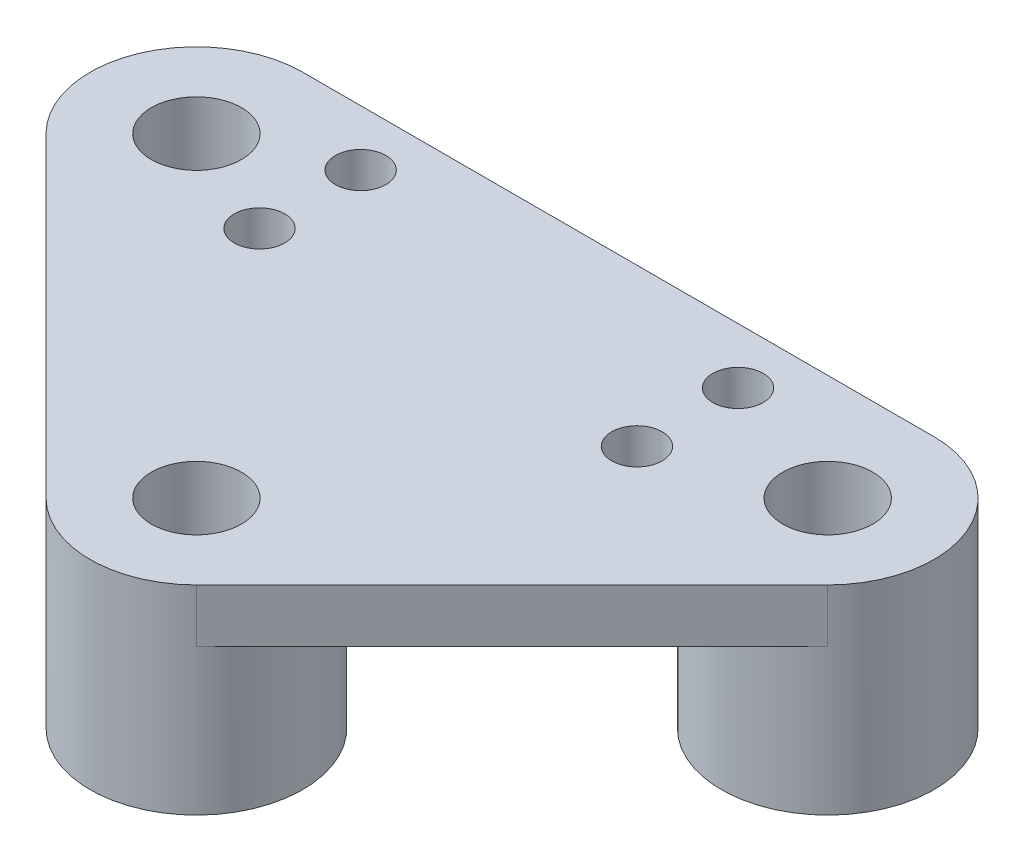
ISO-10303-21;
HEADER;
FILE_DESCRIPTION(('STEP AP214'),'2;1');
FILE_NAME('part.step','',(''),(''),'','','');
FILE_SCHEMA(('AUTOMOTIVE_DESIGN { 1 0 10303 214 1 1 1 1 }'));
ENDSEC;
DATA;
#1=APPLICATION_CONTEXT('core data for automotive mechanical design processes');
#2=APPLICATION_PROTOCOL_DEFINITION('international standard','automotive_design',2000,#1);
#3=PRODUCT_CONTEXT('',#1,'mechanical');
#4=PRODUCT('Part','Part','',(#3));
#5=PRODUCT_RELATED_PRODUCT_CATEGORY('part','',(#4));
#6=PRODUCT_DEFINITION_FORMATION('','',#4);
#7=PRODUCT_DEFINITION_CONTEXT('part definition',#1,'design');
#8=PRODUCT_DEFINITION('design','',#6,#7);
#9=PRODUCT_DEFINITION_SHAPE('','',#8);
#10=(LENGTH_UNIT() NAMED_UNIT(*) SI_UNIT(.MILLI.,.METRE.));
#11=(NAMED_UNIT(*) PLANE_ANGLE_UNIT() SI_UNIT($,.RADIAN.));
#12=(NAMED_UNIT(*) SI_UNIT($,.STERADIAN.) SOLID_ANGLE_UNIT());
#13=UNCERTAINTY_MEASURE_WITH_UNIT(LENGTH_MEASURE(1.E-05),#10,'distance_accuracy_value','');
#14=(GEOMETRIC_REPRESENTATION_CONTEXT(3) GLOBAL_UNCERTAINTY_ASSIGNED_CONTEXT((#13)) GLOBAL_UNIT_ASSIGNED_CONTEXT((#10,
#11,#12)) REPRESENTATION_CONTEXT('',''));
#15=CARTESIAN_POINT('',(0.,0.,0.));
#16=DIRECTION('',(0.,0.,1.));
#17=DIRECTION('',(1.,0.,0.));
#18=AXIS2_PLACEMENT_3D('',#15,#16,#17);
#19=CARTESIAN_POINT('',(-15.08125,-6.985,0.));
#20=DIRECTION('',(0.,-1.,0.));
#21=DIRECTION('',(0.,0.,-1.));
#22=AXIS2_PLACEMENT_3D('',#19,#20,#21);
#23=PLANE('',#22);
#24=CARTESIAN_POINT('',(-15.08125,-6.985,0.));
#25=DIRECTION('',(0.,1.,0.));
#26=DIRECTION('',(0.,0.,1.));
#27=AXIS2_PLACEMENT_3D('',#24,#25,#26);
#28=CIRCLE('',#27,2.15265);
#29=CARTESIAN_POINT('',(-15.08125,-6.985,2.15265));
#30=VERTEX_POINT('',#29);
#31=EDGE_CURVE('E196',#30,#30,#28,.T.);
#32=ORIENTED_EDGE('',*,*,#31,.T.);
#33=EDGE_LOOP('',(#32));
#34=FACE_BOUND('',#33,.T.);
#35=CARTESIAN_POINT('',(-15.08125,-6.985,0.));
#36=DIRECTION('',(0.,-1.,0.));
#37=DIRECTION('',(0.,0.,-1.));
#38=AXIS2_PLACEMENT_3D('',#35,#36,#37);
#39=CIRCLE('',#38,5.08);
#40=CARTESIAN_POINT('',(-10.1785652295985,-6.985,-1.33044430250705));
#41=VERTEX_POINT('',#40);
#42=CARTESIAN_POINT('',(-10.1785652295985,-6.985,1.33044430250705));
#43=VERTEX_POINT('',#42);
#44=EDGE_CURVE('E117',#41,#43,#39,.T.);
#45=ORIENTED_EDGE('',*,*,#44,.T.);
#46=CARTESIAN_POINT('',(-9.650000004,-6.985,2.414999996));
#47=DIRECTION('',(0.,1.,0.));
#48=DIRECTION('',(0.,0.,1.));
#49=AXIS2_PLACEMENT_3D('',#46,#47,#48);
#50=CIRCLE('',#49,1.2065);
#51=CARTESIAN_POINT('',(-10.8093384122214,-6.985,2.74903099040423));
#52=VERTEX_POINT('',#51);
#53=EDGE_CURVE('E50',#43,#52,#50,.T.);
#54=ORIENTED_EDGE('',*,*,#53,.T.);
#55=CARTESIAN_POINT('',(-10.8093384122214,-6.985,-2.74903099040423));
#56=VERTEX_POINT('',#55);
#57=EDGE_CURVE('E57',#52,#56,#39,.T.);
#58=ORIENTED_EDGE('',*,*,#57,.T.);
#59=CARTESIAN_POINT('',(-9.650000004,-6.985,-2.414999996));
#60=DIRECTION('',(0.,1.,0.));
#61=DIRECTION('',(0.,0.,1.));
#62=AXIS2_PLACEMENT_3D('',#59,#60,#61);
#63=CIRCLE('',#62,1.2065);
#64=EDGE_CURVE('E183',#56,#41,#63,.T.);
#65=ORIENTED_EDGE('',*,*,#64,.T.);
#66=EDGE_LOOP('',(#45,#54,#58,#65));
#67=FACE_BOUND('',#66,.T.);
#68=ADVANCED_FACE('F35',(#34,#67),#23,.T.);
#69=CARTESIAN_POINT('',(-15.08125,2.54,0.));
#70=DIRECTION('',(0.,-1.,0.));
#71=DIRECTION('',(0.,0.,-1.));
#72=AXIS2_PLACEMENT_3D('',#69,#70,#71);
#73=CYLINDRICAL_SURFACE('',#72,5.08);
#74=ORIENTED_EDGE('',*,*,#57,.F.);
#75=DIRECTION('',(0.,1.,0.));
#76=VECTOR('',#75,1.);
#77=CARTESIAN_POINT('',(-10.8093384122214,-2.2225,2.74903099040423));
#78=LINE('',#77,#76);
#79=CARTESIAN_POINT('',(-10.8093384122214,0.,2.74903099040423));
#80=VERTEX_POINT('',#79);
#81=EDGE_CURVE('E11',#52,#80,#78,.T.);
#82=ORIENTED_EDGE('',*,*,#81,.T.);
#83=CARTESIAN_POINT('',(-15.08125,0.,0.));
#84=DIRECTION('',(0.,-1.,0.));
#85=DIRECTION('',(0.,0.,-1.));
#86=AXIS2_PLACEMENT_3D('',#83,#84,#85);
#87=CIRCLE('',#86,5.08);
#88=CARTESIAN_POINT('',(-18.6733524484277,0.,3.59210244842766));
#89=VERTEX_POINT('',#88);
#90=EDGE_CURVE('E129',#80,#89,#87,.T.);
#91=ORIENTED_EDGE('',*,*,#90,.T.);
#92=DIRECTION('',(0.,-1.,0.));
#93=VECTOR('',#92,1.);
#94=CARTESIAN_POINT('',(-18.6733524484277,2.54,3.59210244842766));
#95=LINE('',#94,#93);
#96=CARTESIAN_POINT('',(-18.6733524484277,2.54,3.59210244842766));
#97=VERTEX_POINT('',#96);
#98=EDGE_CURVE('E170',#97,#89,#95,.T.);
#99=ORIENTED_EDGE('',*,*,#98,.F.);
#100=CARTESIAN_POINT('',(-15.08125,2.54,0.));
#101=DIRECTION('',(0.,1.,0.));
#102=DIRECTION('',(0.,0.,1.));
#103=AXIS2_PLACEMENT_3D('',#100,#101,#102);
#104=CIRCLE('',#103,5.08);
#105=CARTESIAN_POINT('',(-15.08125,2.54,-5.08));
#106=VERTEX_POINT('',#105);
#107=EDGE_CURVE('E134',#106,#97,#104,.T.);
#108=ORIENTED_EDGE('',*,*,#107,.F.);
#109=DIRECTION('',(0.,-1.,0.));
#110=VECTOR('',#109,1.);
#111=CARTESIAN_POINT('',(-15.08125,2.54,-5.08));
#112=LINE('',#111,#110);
#113=CARTESIAN_POINT('',(-15.08125,0.,-5.08));
#114=VERTEX_POINT('',#113);
#115=EDGE_CURVE('E148',#106,#114,#112,.T.);
#116=ORIENTED_EDGE('',*,*,#115,.T.);
#117=CARTESIAN_POINT('',(-10.8093384122214,0.,-2.74903099040423));
#118=VERTEX_POINT('',#117);
#119=EDGE_CURVE('E124',#114,#118,#87,.T.);
#120=ORIENTED_EDGE('',*,*,#119,.T.);
#121=DIRECTION('',(0.,1.,0.));
#122=VECTOR('',#121,1.);
#123=CARTESIAN_POINT('',(-10.8093384122214,-2.2225,-2.74903099040423));
#124=LINE('',#123,#122);
#125=EDGE_CURVE('E123',#118,#56,#124,.F.);
#126=ORIENTED_EDGE('',*,*,#125,.T.);
#127=EDGE_LOOP('',(#74,#82,#91,#99,#108,#116,#120,#126));
#128=FACE_BOUND('',#127,.T.);
#129=ADVANCED_FACE('F121',(#128),#73,.T.);
#130=CARTESIAN_POINT('',(-15.08125,0.,0.));
#131=DIRECTION('',(0.,1.,0.));
#132=DIRECTION('',(0.,0.,1.));
#133=AXIS2_PLACEMENT_3D('',#130,#131,#132);
#134=PLANE('',#133);
#135=CARTESIAN_POINT('',(8.380000004,0.,2.414999996));
#136=DIRECTION('',(0.,1.,0.));
#137=DIRECTION('',(0.,0.,1.));
#138=AXIS2_PLACEMENT_3D('',#135,#136,#137);
#139=CIRCLE('',#138,1.2065);
#140=CARTESIAN_POINT('',(8.380000004,0.,3.62149999599999));
#141=VERTEX_POINT('',#140);
#142=EDGE_CURVE('E438',#141,#141,#139,.T.);
#143=ORIENTED_EDGE('',*,*,#142,.T.);
#144=EDGE_LOOP('',(#143));
#145=FACE_BOUND('',#144,.T.);
#146=CARTESIAN_POINT('',(8.380000004,0.,-2.414999996));
#147=DIRECTION('',(0.,1.,0.));
#148=DIRECTION('',(0.,0.,1.));
#149=AXIS2_PLACEMENT_3D('',#146,#147,#148);
#150=CIRCLE('',#149,1.2065);
#151=CARTESIAN_POINT('',(8.380000004,0.,-1.208499996));
#152=VERTEX_POINT('',#151);
#153=EDGE_CURVE('E442',#152,#152,#150,.T.);
#154=ORIENTED_EDGE('',*,*,#153,.T.);
#155=EDGE_LOOP('',(#154));
#156=FACE_BOUND('',#155,.T.);
#157=ORIENTED_EDGE('',*,*,#90,.F.);
#158=CARTESIAN_POINT('',(-9.650000004,0.,2.414999996));
#159=DIRECTION('',(0.,1.,0.));
#160=DIRECTION('',(0.,0.,1.));
#161=AXIS2_PLACEMENT_3D('',#158,#159,#160);
#162=CIRCLE('',#161,1.2065);
#163=CARTESIAN_POINT('',(-10.1785652295985,0.,1.33044430250705));
#164=VERTEX_POINT('',#163);
#165=EDGE_CURVE('E112',#80,#164,#162,.T.);
#166=ORIENTED_EDGE('',*,*,#165,.T.);
#167=CARTESIAN_POINT('',(-10.1785652295985,0.,-1.33044430250705));
#168=VERTEX_POINT('',#167);
#169=EDGE_CURVE('E127',#168,#164,#87,.T.);
#170=ORIENTED_EDGE('',*,*,#169,.F.);
#171=CARTESIAN_POINT('',(-9.650000004,0.,-2.414999996));
#172=DIRECTION('',(0.,1.,0.));
#173=DIRECTION('',(0.,0.,1.));
#174=AXIS2_PLACEMENT_3D('',#171,#172,#173);
#175=CIRCLE('',#174,1.2065);
#176=EDGE_CURVE('E189',#168,#118,#175,.T.);
#177=ORIENTED_EDGE('',*,*,#176,.T.);
#178=ORIENTED_EDGE('',*,*,#119,.F.);
#179=DIRECTION('',(-1.,0.,0.));
#180=VECTOR('',#179,1.);
#181=CARTESIAN_POINT('',(-15.08125,0.,-5.08));
#182=LINE('',#181,#180);
#183=CARTESIAN_POINT('',(15.08125,0.,-5.08));
#184=VERTEX_POINT('',#183);
#185=EDGE_CURVE('E138',#184,#114,#182,.T.);
#186=ORIENTED_EDGE('',*,*,#185,.F.);
#187=CARTESIAN_POINT('',(15.08125,0.,0.));
#188=DIRECTION('',(0.,-1.,0.));
#189=DIRECTION('',(0.,0.,-1.));
#190=AXIS2_PLACEMENT_3D('',#187,#188,#189);
#191=CIRCLE('',#190,5.08);
#192=CARTESIAN_POINT('',(18.6733524484277,0.,3.59210244842765));
#193=VERTEX_POINT('',#192);
#194=EDGE_CURVE('E211',#193,#184,#191,.T.);
#195=ORIENTED_EDGE('',*,*,#194,.F.);
#196=DIRECTION('',(0.707106781186547,0.,-0.707106781186548));
#197=VECTOR('',#196,1.);
#198=CARTESIAN_POINT('',(18.6733524484277,0.,3.59210244842765));
#199=LINE('',#198,#197);
#200=CARTESIAN_POINT('',(3.59210244842766,0.,18.6733524484277));
#201=VERTEX_POINT('',#200);
#202=EDGE_CURVE('E151',#201,#193,#199,.T.);
#203=ORIENTED_EDGE('',*,*,#202,.F.);
#204=CARTESIAN_POINT('',(0.,0.,15.08125));
#205=DIRECTION('',(0.,-1.,0.));
#206=DIRECTION('',(0.,0.,-1.));
#207=AXIS2_PLACEMENT_3D('',#204,#205,#206);
#208=CIRCLE('',#207,5.08);
#209=CARTESIAN_POINT('',(-3.59210244842766,0.,18.6733524484277));
#210=VERTEX_POINT('',#209);
#211=EDGE_CURVE('E131',#210,#201,#208,.T.);
#212=ORIENTED_EDGE('',*,*,#211,.F.);
#213=DIRECTION('',(0.707106781186548,0.,0.707106781186547));
#214=VECTOR('',#213,1.);
#215=CARTESIAN_POINT('',(-3.59210244842766,0.,18.6733524484277));
#216=LINE('',#215,#214);
#217=EDGE_CURVE('E126',#89,#210,#216,.T.);
#218=ORIENTED_EDGE('',*,*,#217,.F.);
#219=EDGE_LOOP('',(#157,#166,#170,#177,#178,#186,#195,#203,#212,#218));
#220=FACE_BOUND('',#219,.T.);
#221=ADVANCED_FACE('F177',(#145,#156,#220),#134,.F.);
#222=ORIENTED_EDGE('',*,*,#169,.T.);
#223=DIRECTION('',(0.,1.,0.));
#224=VECTOR('',#223,1.);
#225=CARTESIAN_POINT('',(-10.1785652295985,-2.2225,1.33044430250705));
#226=LINE('',#225,#224);
#227=EDGE_CURVE('E43',#164,#43,#226,.F.);
#228=ORIENTED_EDGE('',*,*,#227,.T.);
#229=ORIENTED_EDGE('',*,*,#44,.F.);
#230=DIRECTION('',(0.,1.,0.));
#231=VECTOR('',#230,1.);
#232=CARTESIAN_POINT('',(-10.1785652295985,-2.2225,-1.33044430250705));
#233=LINE('',#232,#231);
#234=EDGE_CURVE('E191',#41,#168,#233,.T.);
#235=ORIENTED_EDGE('',*,*,#234,.T.);
#236=EDGE_LOOP('',(#222,#228,#229,#235));
#237=FACE_BOUND('',#236,.T.);
#238=ADVANCED_FACE('F37',(#237),#73,.T.);
#239=CARTESIAN_POINT('',(-3.59210244842766,2.54,18.6733524484277));
#240=DIRECTION('',(0.707106781186547,0.,-0.707106781186548));
#241=DIRECTION('',(-0.707106781186548,0.,-0.707106781186547));
#242=AXIS2_PLACEMENT_3D('',#239,#240,#241);
#243=PLANE('',#242);
#244=ORIENTED_EDGE('',*,*,#217,.T.);
#245=DIRECTION('',(0.,-1.,0.));
#246=VECTOR('',#245,1.);
#247=CARTESIAN_POINT('',(-3.59210244842766,2.54,18.6733524484277));
#248=LINE('',#247,#246);
#249=CARTESIAN_POINT('',(-3.59210244842766,2.54,18.6733524484277));
#250=VERTEX_POINT('',#249);
#251=EDGE_CURVE('E167',#250,#210,#248,.T.);
#252=ORIENTED_EDGE('',*,*,#251,.F.);
#253=DIRECTION('',(0.707106781186548,0.,0.707106781186547));
#254=VECTOR('',#253,1.);
#255=CARTESIAN_POINT('',(-3.59210244842766,2.54,18.6733524484277));
#256=LINE('',#255,#254);
#257=EDGE_CURVE('E137',#97,#250,#256,.T.);
#258=ORIENTED_EDGE('',*,*,#257,.F.);
#259=ORIENTED_EDGE('',*,*,#98,.T.);
#260=EDGE_LOOP('',(#244,#252,#258,#259));
#261=FACE_BOUND('',#260,.T.);
#262=ADVANCED_FACE('F245',(#261),#243,.F.);
#263=CARTESIAN_POINT('',(0.,2.54,15.08125));
#264=DIRECTION('',(0.,-1.,0.));
#265=DIRECTION('',(0.,0.,-1.));
#266=AXIS2_PLACEMENT_3D('',#263,#264,#265);
#267=CYLINDRICAL_SURFACE('',#266,5.08);
#268=ORIENTED_EDGE('',*,*,#251,.T.);
#269=ORIENTED_EDGE('',*,*,#211,.T.);
#270=DIRECTION('',(0.,-1.,0.));
#271=VECTOR('',#270,1.);
#272=CARTESIAN_POINT('',(3.59210244842766,2.54,18.6733524484277));
#273=LINE('',#272,#271);
#274=CARTESIAN_POINT('',(3.59210244842766,2.54,18.6733524484277));
#275=VERTEX_POINT('',#274);
#276=EDGE_CURVE('E164',#275,#201,#273,.T.);
#277=ORIENTED_EDGE('',*,*,#276,.F.);
#278=CARTESIAN_POINT('',(0.,2.54,15.08125));
#279=DIRECTION('',(0.,1.,0.));
#280=DIRECTION('',(0.,0.,1.));
#281=AXIS2_PLACEMENT_3D('',#278,#279,#280);
#282=CIRCLE('',#281,5.08);
#283=EDGE_CURVE('E140',#250,#275,#282,.T.);
#284=ORIENTED_EDGE('',*,*,#283,.F.);
#285=EDGE_LOOP('',(#268,#269,#277,#284));
#286=FACE_BOUND('',#285,.T.);
#287=CARTESIAN_POINT('',(0.,-6.985,15.08125));
#288=DIRECTION('',(0.,-1.,0.));
#289=DIRECTION('',(0.,0.,-1.));
#290=AXIS2_PLACEMENT_3D('',#287,#288,#289);
#291=CIRCLE('',#290,5.08);
#292=CARTESIAN_POINT('',(0.,-6.985,10.00125));
#293=VERTEX_POINT('',#292);
#294=EDGE_CURVE('E215',#293,#293,#291,.T.);
#295=ORIENTED_EDGE('',*,*,#294,.F.);
#296=EDGE_LOOP('',(#295));
#297=FACE_BOUND('',#296,.T.);
#298=ADVANCED_FACE('F221',(#286,#297),#267,.T.);
#299=CARTESIAN_POINT('',(18.6733524484277,2.54,3.59210244842765));
#300=DIRECTION('',(-0.707106781186548,0.,-0.707106781186547));
#301=DIRECTION('',(-0.707106781186547,0.,0.707106781186548));
#302=AXIS2_PLACEMENT_3D('',#299,#300,#301);
#303=PLANE('',#302);
#304=ORIENTED_EDGE('',*,*,#202,.T.);
#305=DIRECTION('',(0.,-1.,0.));
#306=VECTOR('',#305,1.);
#307=CARTESIAN_POINT('',(18.6733524484277,2.54,3.59210244842765));
#308=LINE('',#307,#306);
#309=CARTESIAN_POINT('',(18.6733524484277,2.54,3.59210244842765));
#310=VERTEX_POINT('',#309);
#311=EDGE_CURVE('E161',#310,#193,#308,.T.);
#312=ORIENTED_EDGE('',*,*,#311,.F.);
#313=DIRECTION('',(0.707106781186547,0.,-0.707106781186548));
#314=VECTOR('',#313,1.);
#315=CARTESIAN_POINT('',(18.6733524484277,2.54,3.59210244842765));
#316=LINE('',#315,#314);
#317=EDGE_CURVE('E142',#275,#310,#316,.T.);
#318=ORIENTED_EDGE('',*,*,#317,.F.);
#319=ORIENTED_EDGE('',*,*,#276,.T.);
#320=EDGE_LOOP('',(#304,#312,#318,#319));
#321=FACE_BOUND('',#320,.T.);
#322=ADVANCED_FACE('F228',(#321),#303,.F.);
#323=CARTESIAN_POINT('',(15.08125,2.54,0.));
#324=DIRECTION('',(0.,-1.,0.));
#325=DIRECTION('',(0.,0.,-1.));
#326=AXIS2_PLACEMENT_3D('',#323,#324,#325);
#327=CYLINDRICAL_SURFACE('',#326,5.08);
#328=ORIENTED_EDGE('',*,*,#311,.T.);
#329=ORIENTED_EDGE('',*,*,#194,.T.);
#330=DIRECTION('',(0.,-1.,0.));
#331=VECTOR('',#330,1.);
#332=CARTESIAN_POINT('',(15.08125,2.54,-5.08));
#333=LINE('',#332,#331);
#334=CARTESIAN_POINT('',(15.08125,2.54,-5.08));
#335=VERTEX_POINT('',#334);
#336=EDGE_CURVE('E158',#335,#184,#333,.T.);
#337=ORIENTED_EDGE('',*,*,#336,.F.);
#338=CARTESIAN_POINT('',(15.08125,2.54,0.));
#339=DIRECTION('',(0.,1.,0.));
#340=DIRECTION('',(0.,0.,1.));
#341=AXIS2_PLACEMENT_3D('',#338,#339,#340);
#342=CIRCLE('',#341,5.08);
#343=EDGE_CURVE('E144',#310,#335,#342,.T.);
#344=ORIENTED_EDGE('',*,*,#343,.F.);
#345=EDGE_LOOP('',(#328,#329,#337,#344));
#346=FACE_BOUND('',#345,.T.);
#347=CARTESIAN_POINT('',(15.08125,-6.985,0.));
#348=DIRECTION('',(0.,-1.,0.));
#349=DIRECTION('',(0.,0.,-1.));
#350=AXIS2_PLACEMENT_3D('',#347,#348,#349);
#351=CIRCLE('',#350,5.08);
#352=CARTESIAN_POINT('',(15.08125,-6.985,-5.08));
#353=VERTEX_POINT('',#352);
#354=EDGE_CURVE('E212',#353,#353,#351,.T.);
#355=ORIENTED_EDGE('',*,*,#354,.F.);
#356=EDGE_LOOP('',(#355));
#357=FACE_BOUND('',#356,.T.);
#358=ADVANCED_FACE('F233',(#346,#357),#327,.T.);
#359=CARTESIAN_POINT('',(-15.08125,2.54,-5.08));
#360=DIRECTION('',(0.,0.,1.));
#361=DIRECTION('',(1.,0.,0.));
#362=AXIS2_PLACEMENT_3D('',#359,#360,#361);
#363=PLANE('',#362);
#364=ORIENTED_EDGE('',*,*,#185,.T.);
#365=ORIENTED_EDGE('',*,*,#115,.F.);
#366=DIRECTION('',(-1.,0.,0.));
#367=VECTOR('',#366,1.);
#368=CARTESIAN_POINT('',(-15.08125,2.54,-5.08));
#369=LINE('',#368,#367);
#370=EDGE_CURVE('E146',#335,#106,#369,.T.);
#371=ORIENTED_EDGE('',*,*,#370,.F.);
#372=ORIENTED_EDGE('',*,*,#336,.T.);
#373=EDGE_LOOP('',(#364,#365,#371,#372));
#374=FACE_BOUND('',#373,.T.);
#375=ADVANCED_FACE('F238',(#374),#363,.F.);
#376=CARTESIAN_POINT('',(-15.08125,2.54,0.));
#377=DIRECTION('',(0.,1.,0.));
#378=DIRECTION('',(0.,0.,1.));
#379=AXIS2_PLACEMENT_3D('',#376,#377,#378);
#380=PLANE('',#379);
#381=CARTESIAN_POINT('',(8.380000004,2.54,2.414999996));
#382=DIRECTION('',(0.,1.,0.));
#383=DIRECTION('',(0.,0.,1.));
#384=AXIS2_PLACEMENT_3D('',#381,#382,#383);
#385=CIRCLE('',#384,1.2065);
#386=CARTESIAN_POINT('',(8.380000004,2.54,3.621499996));
#387=VERTEX_POINT('',#386);
#388=EDGE_CURVE('E435',#387,#387,#385,.T.);
#389=ORIENTED_EDGE('',*,*,#388,.F.);
#390=EDGE_LOOP('',(#389));
#391=FACE_BOUND('',#390,.T.);
#392=CARTESIAN_POINT('',(8.380000004,2.54,-2.414999996));
#393=DIRECTION('',(0.,1.,0.));
#394=DIRECTION('',(0.,0.,1.));
#395=AXIS2_PLACEMENT_3D('',#392,#393,#394);
#396=CIRCLE('',#395,1.2065);
#397=CARTESIAN_POINT('',(8.380000004,2.54,-1.208499996));
#398=VERTEX_POINT('',#397);
#399=EDGE_CURVE('E439',#398,#398,#396,.T.);
#400=ORIENTED_EDGE('',*,*,#399,.F.);
#401=EDGE_LOOP('',(#400));
#402=FACE_BOUND('',#401,.T.);
#403=CARTESIAN_POINT('',(-9.650000004,2.54,2.414999996));
#404=DIRECTION('',(0.,1.,0.));
#405=DIRECTION('',(0.,0.,1.));
#406=AXIS2_PLACEMENT_3D('',#403,#404,#405);
#407=CIRCLE('',#406,1.2065);
#408=CARTESIAN_POINT('',(-9.650000004,2.54,3.621499996));
#409=VERTEX_POINT('',#408);
#410=EDGE_CURVE('E118',#409,#409,#407,.T.);
#411=ORIENTED_EDGE('',*,*,#410,.F.);
#412=EDGE_LOOP('',(#411));
#413=FACE_BOUND('',#412,.T.);
#414=CARTESIAN_POINT('',(-9.650000004,2.54,-2.414999996));
#415=DIRECTION('',(0.,1.,0.));
#416=DIRECTION('',(0.,0.,1.));
#417=AXIS2_PLACEMENT_3D('',#414,#415,#416);
#418=CIRCLE('',#417,1.2065);
#419=CARTESIAN_POINT('',(-9.650000004,2.54,-1.208499996));
#420=VERTEX_POINT('',#419);
#421=EDGE_CURVE('E180',#420,#420,#418,.T.);
#422=ORIENTED_EDGE('',*,*,#421,.F.);
#423=EDGE_LOOP('',(#422));
#424=FACE_BOUND('',#423,.T.);
#425=CARTESIAN_POINT('',(-15.08125,2.54,0.));
#426=DIRECTION('',(0.,1.,0.));
#427=DIRECTION('',(0.,0.,1.));
#428=AXIS2_PLACEMENT_3D('',#425,#426,#427);
#429=CIRCLE('',#428,2.15265);
#430=CARTESIAN_POINT('',(-15.08125,2.54,2.15265));
#431=VERTEX_POINT('',#430);
#432=EDGE_CURVE('E193',#431,#431,#429,.T.);
#433=ORIENTED_EDGE('',*,*,#432,.F.);
#434=EDGE_LOOP('',(#433));
#435=FACE_BOUND('',#434,.T.);
#436=CARTESIAN_POINT('',(0.,2.54,15.08125));
#437=DIRECTION('',(0.,1.,0.));
#438=DIRECTION('',(0.,0.,1.));
#439=AXIS2_PLACEMENT_3D('',#436,#437,#438);
#440=CIRCLE('',#439,2.15265);
#441=CARTESIAN_POINT('',(0.,2.54,17.2339));
#442=VERTEX_POINT('',#441);
#443=EDGE_CURVE('E199',#442,#442,#440,.T.);
#444=ORIENTED_EDGE('',*,*,#443,.F.);
#445=EDGE_LOOP('',(#444));
#446=FACE_BOUND('',#445,.T.);
#447=CARTESIAN_POINT('',(15.08125,2.54,0.));
#448=DIRECTION('',(0.,1.,0.));
#449=DIRECTION('',(0.,0.,1.));
#450=AXIS2_PLACEMENT_3D('',#447,#448,#449);
#451=CIRCLE('',#450,2.15265);
#452=CARTESIAN_POINT('',(15.08125,2.54,2.15264999999999));
#453=VERTEX_POINT('',#452);
#454=EDGE_CURVE('E205',#453,#453,#451,.T.);
#455=ORIENTED_EDGE('',*,*,#454,.F.);
#456=EDGE_LOOP('',(#455));
#457=FACE_BOUND('',#456,.T.);
#458=ORIENTED_EDGE('',*,*,#107,.T.);
#459=ORIENTED_EDGE('',*,*,#257,.T.);
#460=ORIENTED_EDGE('',*,*,#283,.T.);
#461=ORIENTED_EDGE('',*,*,#317,.T.);
#462=ORIENTED_EDGE('',*,*,#343,.T.);
#463=ORIENTED_EDGE('',*,*,#370,.T.);
#464=EDGE_LOOP('',(#458,#459,#460,#461,#462,#463));
#465=FACE_BOUND('',#464,.T.);
#466=ADVANCED_FACE('F242',(#391,#402,#413,#424,#435,#446,#457,#465),#380,.T.);
#467=CARTESIAN_POINT('',(0.,-6.985,15.08125));
#468=DIRECTION('',(0.,-1.,0.));
#469=DIRECTION('',(0.,0.,-1.));
#470=AXIS2_PLACEMENT_3D('',#467,#468,#469);
#471=PLANE('',#470);
#472=CARTESIAN_POINT('',(0.,-6.985,15.08125));
#473=DIRECTION('',(0.,1.,0.));
#474=DIRECTION('',(0.,0.,1.));
#475=AXIS2_PLACEMENT_3D('',#472,#473,#474);
#476=CIRCLE('',#475,2.15265);
#477=CARTESIAN_POINT('',(0.,-6.985,17.2339));
#478=VERTEX_POINT('',#477);
#479=EDGE_CURVE('E202',#478,#478,#476,.T.);
#480=ORIENTED_EDGE('',*,*,#479,.T.);
#481=EDGE_LOOP('',(#480));
#482=FACE_BOUND('',#481,.T.);
#483=ORIENTED_EDGE('',*,*,#294,.T.);
#484=EDGE_LOOP('',(#483));
#485=FACE_BOUND('',#484,.T.);
#486=ADVANCED_FACE('F270',(#482,#485),#471,.T.);
#487=CARTESIAN_POINT('',(15.08125,-6.985,0.));
#488=DIRECTION('',(0.,-1.,0.));
#489=DIRECTION('',(0.,0.,-1.));
#490=AXIS2_PLACEMENT_3D('',#487,#488,#489);
#491=PLANE('',#490);
#492=CARTESIAN_POINT('',(15.08125,-6.985,0.));
#493=DIRECTION('',(0.,1.,0.));
#494=DIRECTION('',(0.,0.,1.));
#495=AXIS2_PLACEMENT_3D('',#492,#493,#494);
#496=CIRCLE('',#495,2.15265);
#497=CARTESIAN_POINT('',(15.08125,-6.985,2.15264999999999));
#498=VERTEX_POINT('',#497);
#499=EDGE_CURVE('E208',#498,#498,#496,.T.);
#500=ORIENTED_EDGE('',*,*,#499,.T.);
#501=EDGE_LOOP('',(#500));
#502=FACE_BOUND('',#501,.T.);
#503=ORIENTED_EDGE('',*,*,#354,.T.);
#504=EDGE_LOOP('',(#503));
#505=FACE_BOUND('',#504,.T.);
#506=ADVANCED_FACE('F331',(#502,#505),#491,.T.);
#507=CARTESIAN_POINT('',(15.08125,2.54,0.));
#508=DIRECTION('',(0.,1.,0.));
#509=DIRECTION('',(0.,0.,1.));
#510=AXIS2_PLACEMENT_3D('',#507,#508,#509);
#511=CYLINDRICAL_SURFACE('',#510,2.15265);
#512=ORIENTED_EDGE('',*,*,#499,.F.);
#513=EDGE_LOOP('',(#512));
#514=FACE_BOUND('',#513,.T.);
#515=ORIENTED_EDGE('',*,*,#454,.T.);
#516=EDGE_LOOP('',(#515));
#517=FACE_BOUND('',#516,.T.);
#518=ADVANCED_FACE('F321',(#514,#517),#511,.F.);
#519=CARTESIAN_POINT('',(0.,2.54,15.08125));
#520=DIRECTION('',(0.,1.,0.));
#521=DIRECTION('',(0.,0.,1.));
#522=AXIS2_PLACEMENT_3D('',#519,#520,#521);
#523=CYLINDRICAL_SURFACE('',#522,2.15265);
#524=ORIENTED_EDGE('',*,*,#479,.F.);
#525=EDGE_LOOP('',(#524));
#526=FACE_BOUND('',#525,.T.);
#527=ORIENTED_EDGE('',*,*,#443,.T.);
#528=EDGE_LOOP('',(#527));
#529=FACE_BOUND('',#528,.T.);
#530=ADVANCED_FACE('F259',(#526,#529),#523,.F.);
#531=CARTESIAN_POINT('',(-15.08125,2.54,0.));
#532=DIRECTION('',(0.,1.,0.));
#533=DIRECTION('',(0.,0.,1.));
#534=AXIS2_PLACEMENT_3D('',#531,#532,#533);
#535=CYLINDRICAL_SURFACE('',#534,2.15265);
#536=ORIENTED_EDGE('',*,*,#31,.F.);
#537=EDGE_LOOP('',(#536));
#538=FACE_BOUND('',#537,.T.);
#539=ORIENTED_EDGE('',*,*,#432,.T.);
#540=EDGE_LOOP('',(#539));
#541=FACE_BOUND('',#540,.T.);
#542=ADVANCED_FACE('F249',(#538,#541),#535,.F.);
#543=CARTESIAN_POINT('',(-9.650000004,2.54,-2.414999996));
#544=DIRECTION('',(0.,1.,0.));
#545=DIRECTION('',(0.,0.,1.));
#546=AXIS2_PLACEMENT_3D('',#543,#544,#545);
#547=CYLINDRICAL_SURFACE('',#546,1.2065);
#548=ORIENTED_EDGE('',*,*,#421,.T.);
#549=EDGE_LOOP('',(#548));
#550=FACE_BOUND('',#549,.T.);
#551=ORIENTED_EDGE('',*,*,#64,.F.);
#552=ORIENTED_EDGE('',*,*,#125,.F.);
#553=ORIENTED_EDGE('',*,*,#176,.F.);
#554=ORIENTED_EDGE('',*,*,#234,.F.);
#555=EDGE_LOOP('',(#551,#552,#553,#554));
#556=FACE_BOUND('',#555,.T.);
#557=ADVANCED_FACE('F247',(#550,#556),#547,.F.);
#558=CARTESIAN_POINT('',(-9.650000004,2.54,2.414999996));
#559=DIRECTION('',(0.,1.,0.));
#560=DIRECTION('',(0.,0.,1.));
#561=AXIS2_PLACEMENT_3D('',#558,#559,#560);
#562=CYLINDRICAL_SURFACE('',#561,1.2065);
#563=ORIENTED_EDGE('',*,*,#410,.T.);
#564=EDGE_LOOP('',(#563));
#565=FACE_BOUND('',#564,.T.);
#566=ORIENTED_EDGE('',*,*,#53,.F.);
#567=ORIENTED_EDGE('',*,*,#227,.F.);
#568=ORIENTED_EDGE('',*,*,#165,.F.);
#569=ORIENTED_EDGE('',*,*,#81,.F.);
#570=EDGE_LOOP('',(#566,#567,#568,#569));
#571=FACE_BOUND('',#570,.T.);
#572=ADVANCED_FACE('F110',(#565,#571),#562,.F.);
#573=CARTESIAN_POINT('',(8.380000004,2.54,-2.414999996));
#574=DIRECTION('',(0.,1.,0.));
#575=DIRECTION('',(0.,0.,1.));
#576=AXIS2_PLACEMENT_3D('',#573,#574,#575);
#577=CYLINDRICAL_SURFACE('',#576,1.2065);
#578=ORIENTED_EDGE('',*,*,#399,.T.);
#579=EDGE_LOOP('',(#578));
#580=FACE_BOUND('',#579,.T.);
#581=ORIENTED_EDGE('',*,*,#153,.F.);
#582=EDGE_LOOP('',(#581));
#583=FACE_BOUND('',#582,.T.);
#584=ADVANCED_FACE('F256',(#580,#583),#577,.F.);
#585=CARTESIAN_POINT('',(8.380000004,2.54,2.414999996));
#586=DIRECTION('',(0.,1.,0.));
#587=DIRECTION('',(0.,0.,1.));
#588=AXIS2_PLACEMENT_3D('',#585,#586,#587);
#589=CYLINDRICAL_SURFACE('',#588,1.2065);
#590=ORIENTED_EDGE('',*,*,#388,.T.);
#591=EDGE_LOOP('',(#590));
#592=FACE_BOUND('',#591,.T.);
#593=ORIENTED_EDGE('',*,*,#142,.F.);
#594=EDGE_LOOP('',(#593));
#595=FACE_BOUND('',#594,.T.);
#596=ADVANCED_FACE('F414',(#592,#595),#589,.F.);
#597=CLOSED_SHELL('',(#68,#129,#221,#238,#262,#298,#322,#358,#375,#466,#486,#506,#518,#530,#542,
#557,#572,#584,#596));
#598=MANIFOLD_SOLID_BREP('B2',#597);
#599=ADVANCED_BREP_SHAPE_REPRESENTATION('',(#18,#598),#14);
#600=SHAPE_DEFINITION_REPRESENTATION(#9,#599);
ENDSEC;
END-ISO-10303-21;
